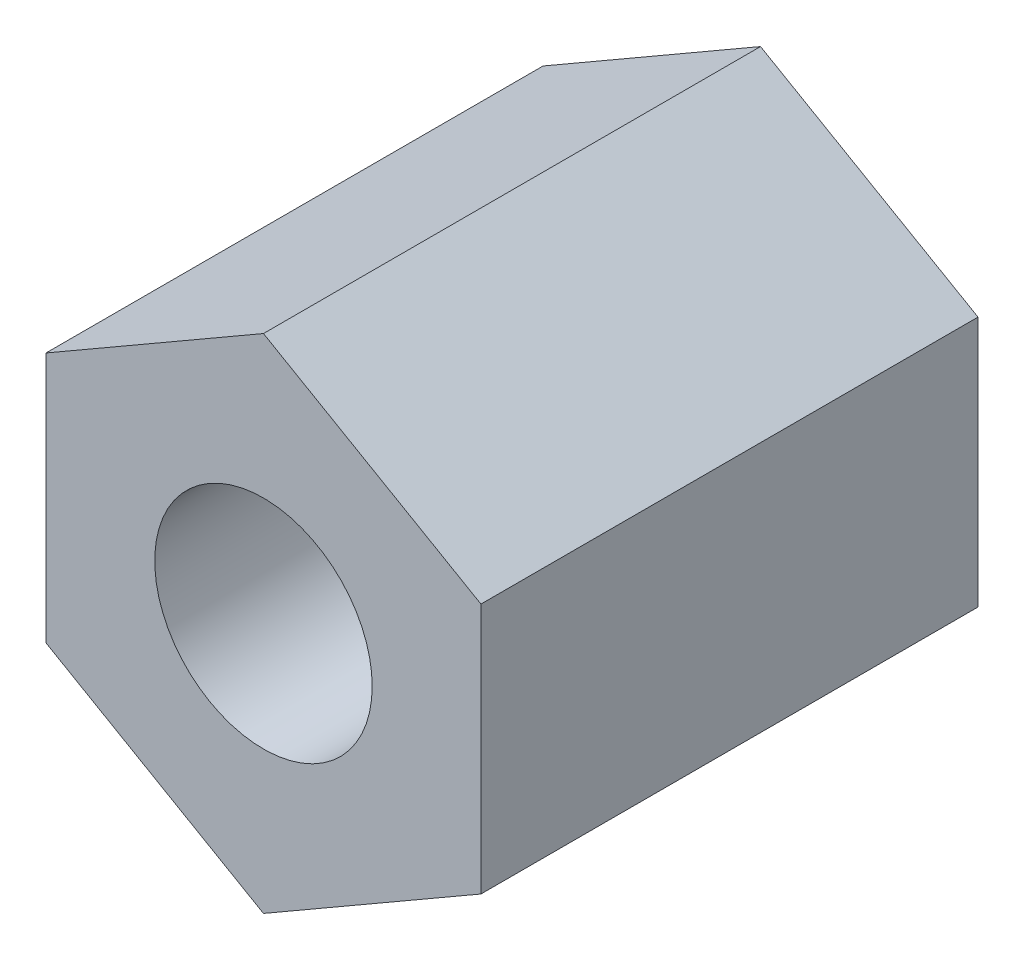
ISO-10303-21;
HEADER;
FILE_DESCRIPTION(('STEP AP214'),'2;1');
FILE_NAME('part.step','',(''),(''),'','','');
FILE_SCHEMA(('AUTOMOTIVE_DESIGN { 1 0 10303 214 1 1 1 1 }'));
ENDSEC;
DATA;
#1=APPLICATION_CONTEXT('core data for automotive mechanical design processes');
#2=APPLICATION_PROTOCOL_DEFINITION('international standard','automotive_design',2000,#1);
#3=PRODUCT_CONTEXT('',#1,'mechanical');
#4=PRODUCT('Part','Part','',(#3));
#5=PRODUCT_RELATED_PRODUCT_CATEGORY('part','',(#4));
#6=PRODUCT_DEFINITION_FORMATION('','',#4);
#7=PRODUCT_DEFINITION_CONTEXT('part definition',#1,'design');
#8=PRODUCT_DEFINITION('design','',#6,#7);
#9=PRODUCT_DEFINITION_SHAPE('','',#8);
#10=(LENGTH_UNIT() NAMED_UNIT(*) SI_UNIT(.MILLI.,.METRE.));
#11=(NAMED_UNIT(*) PLANE_ANGLE_UNIT() SI_UNIT($,.RADIAN.));
#12=(NAMED_UNIT(*) SI_UNIT($,.STERADIAN.) SOLID_ANGLE_UNIT());
#13=UNCERTAINTY_MEASURE_WITH_UNIT(LENGTH_MEASURE(1.E-05),#10,'distance_accuracy_value','');
#14=(GEOMETRIC_REPRESENTATION_CONTEXT(3) GLOBAL_UNCERTAINTY_ASSIGNED_CONTEXT((#13)) GLOBAL_UNIT_ASSIGNED_CONTEXT((#10,
#11,#12)) REPRESENTATION_CONTEXT('',''));
#15=CARTESIAN_POINT('',(0.,0.,0.));
#16=DIRECTION('',(0.,0.,1.));
#17=DIRECTION('',(1.,0.,0.));
#18=AXIS2_PLACEMENT_3D('',#15,#16,#17);
#19=CARTESIAN_POINT('',(0.,0.,8.));
#20=DIRECTION('',(0.,0.,-1.));
#21=DIRECTION('',(-1.,0.,0.));
#22=AXIS2_PLACEMENT_3D('',#19,#20,#21);
#23=PLANE('',#22);
#24=DIRECTION('',(-0.86602540378444,0.499999999999998,0.));
#25=VECTOR('',#24,1.);
#26=CARTESIAN_POINT('',(3.50000000000001,2.02072594216369,8.));
#27=LINE('',#26,#25);
#28=CARTESIAN_POINT('',(3.50000000000001,2.02072594216369,8.));
#29=VERTEX_POINT('',#28);
#30=CARTESIAN_POINT('',(0.,4.04145188432738,8.));
#31=VERTEX_POINT('',#30);
#32=EDGE_CURVE('E128',#29,#31,#27,.T.);
#33=ORIENTED_EDGE('',*,*,#32,.T.);
#34=DIRECTION('',(-0.86602540378444,-0.499999999999998,0.));
#35=VECTOR('',#34,1.);
#36=CARTESIAN_POINT('',(-3.50000000000001,2.02072594216369,8.));
#37=LINE('',#36,#35);
#38=CARTESIAN_POINT('',(-3.50000000000001,2.02072594216369,8.));
#39=VERTEX_POINT('',#38);
#40=EDGE_CURVE('E86',#31,#39,#37,.T.);
#41=ORIENTED_EDGE('',*,*,#40,.T.);
#42=DIRECTION('',(0.,-1.,0.));
#43=VECTOR('',#42,1.);
#44=CARTESIAN_POINT('',(-3.50000000000001,-2.02072594216369,8.));
#45=LINE('',#44,#43);
#46=CARTESIAN_POINT('',(-3.50000000000001,-2.02072594216369,8.));
#47=VERTEX_POINT('',#46);
#48=EDGE_CURVE('E99',#39,#47,#45,.T.);
#49=ORIENTED_EDGE('',*,*,#48,.T.);
#50=DIRECTION('',(0.86602540378444,-0.499999999999998,0.));
#51=VECTOR('',#50,1.);
#52=CARTESIAN_POINT('',(-3.50000000000001,-2.02072594216369,8.));
#53=LINE('',#52,#51);
#54=CARTESIAN_POINT('',(0.,-4.04145188432738,8.));
#55=VERTEX_POINT('',#54);
#56=EDGE_CURVE('E93',#47,#55,#53,.T.);
#57=ORIENTED_EDGE('',*,*,#56,.T.);
#58=DIRECTION('',(0.86602540378444,0.499999999999998,0.));
#59=VECTOR('',#58,1.);
#60=CARTESIAN_POINT('',(3.50000000000001,-2.02072594216369,8.));
#61=LINE('',#60,#59);
#62=CARTESIAN_POINT('',(3.50000000000001,-2.02072594216369,8.));
#63=VERTEX_POINT('',#62);
#64=EDGE_CURVE('E97',#55,#63,#61,.T.);
#65=ORIENTED_EDGE('',*,*,#64,.T.);
#66=DIRECTION('',(0.,1.,0.));
#67=VECTOR('',#66,1.);
#68=CARTESIAN_POINT('',(3.50000000000001,-2.02072594216369,8.));
#69=LINE('',#68,#67);
#70=EDGE_CURVE('E49',#63,#29,#69,.T.);
#71=ORIENTED_EDGE('',*,*,#70,.T.);
#72=EDGE_LOOP('',(#33,#41,#49,#57,#65,#71));
#73=FACE_BOUND('',#72,.T.);
#74=CARTESIAN_POINT('',(0.,0.,8.));
#75=DIRECTION('',(0.,0.,1.));
#76=DIRECTION('',(1.,0.,0.));
#77=AXIS2_PLACEMENT_3D('',#74,#75,#76);
#78=CIRCLE('',#77,1.75);
#79=CARTESIAN_POINT('',(1.75,0.,8.));
#80=VERTEX_POINT('',#79);
#81=EDGE_CURVE('E121',#80,#80,#78,.T.);
#82=ORIENTED_EDGE('',*,*,#81,.F.);
#83=EDGE_LOOP('',(#82));
#84=FACE_BOUND('',#83,.T.);
#85=ADVANCED_FACE('F32',(#73,#84),#23,.F.);
#86=CARTESIAN_POINT('',(0.,0.,0.));
#87=DIRECTION('',(0.,0.,-1.));
#88=DIRECTION('',(-1.,0.,0.));
#89=AXIS2_PLACEMENT_3D('',#86,#87,#88);
#90=PLANE('',#89);
#91=DIRECTION('',(-0.86602540378444,0.499999999999998,0.));
#92=VECTOR('',#91,1.);
#93=CARTESIAN_POINT('',(3.50000000000001,2.02072594216369,0.));
#94=LINE('',#93,#92);
#95=CARTESIAN_POINT('',(3.50000000000001,2.02072594216369,0.));
#96=VERTEX_POINT('',#95);
#97=CARTESIAN_POINT('',(0.,4.04145188432738,0.));
#98=VERTEX_POINT('',#97);
#99=EDGE_CURVE('E117',#96,#98,#94,.T.);
#100=ORIENTED_EDGE('',*,*,#99,.F.);
#101=DIRECTION('',(0.,1.,0.));
#102=VECTOR('',#101,1.);
#103=CARTESIAN_POINT('',(3.50000000000001,-2.02072594216369,0.));
#104=LINE('',#103,#102);
#105=CARTESIAN_POINT('',(3.50000000000001,-2.02072594216369,0.));
#106=VERTEX_POINT('',#105);
#107=EDGE_CURVE('E78',#106,#96,#104,.T.);
#108=ORIENTED_EDGE('',*,*,#107,.F.);
#109=DIRECTION('',(0.86602540378444,0.499999999999998,0.));
#110=VECTOR('',#109,1.);
#111=CARTESIAN_POINT('',(3.50000000000001,-2.02072594216369,0.));
#112=LINE('',#111,#110);
#113=CARTESIAN_POINT('',(0.,-4.04145188432738,0.));
#114=VERTEX_POINT('',#113);
#115=EDGE_CURVE('E72',#114,#106,#112,.T.);
#116=ORIENTED_EDGE('',*,*,#115,.F.);
#117=DIRECTION('',(0.86602540378444,-0.499999999999998,0.));
#118=VECTOR('',#117,1.);
#119=CARTESIAN_POINT('',(-3.50000000000001,-2.02072594216369,0.));
#120=LINE('',#119,#118);
#121=CARTESIAN_POINT('',(-3.50000000000001,-2.02072594216369,0.));
#122=VERTEX_POINT('',#121);
#123=EDGE_CURVE('E107',#122,#114,#120,.T.);
#124=ORIENTED_EDGE('',*,*,#123,.F.);
#125=DIRECTION('',(0.,-1.,0.));
#126=VECTOR('',#125,1.);
#127=CARTESIAN_POINT('',(-3.50000000000001,-2.02072594216369,0.));
#128=LINE('',#127,#126);
#129=CARTESIAN_POINT('',(-3.50000000000001,2.02072594216369,0.));
#130=VERTEX_POINT('',#129);
#131=EDGE_CURVE('E123',#130,#122,#128,.T.);
#132=ORIENTED_EDGE('',*,*,#131,.F.);
#133=DIRECTION('',(-0.86602540378444,-0.499999999999998,0.));
#134=VECTOR('',#133,1.);
#135=CARTESIAN_POINT('',(-3.50000000000001,2.02072594216369,0.));
#136=LINE('',#135,#134);
#137=EDGE_CURVE('E120',#98,#130,#136,.T.);
#138=ORIENTED_EDGE('',*,*,#137,.F.);
#139=EDGE_LOOP('',(#100,#108,#116,#124,#132,#138));
#140=FACE_BOUND('',#139,.T.);
#141=CARTESIAN_POINT('',(0.,0.,0.));
#142=DIRECTION('',(0.,0.,1.));
#143=DIRECTION('',(1.,0.,0.));
#144=AXIS2_PLACEMENT_3D('',#141,#142,#143);
#145=CIRCLE('',#144,1.75);
#146=CARTESIAN_POINT('',(1.75,0.,0.));
#147=VERTEX_POINT('',#146);
#148=EDGE_CURVE('E221',#147,#147,#145,.T.);
#149=ORIENTED_EDGE('',*,*,#148,.T.);
#150=EDGE_LOOP('',(#149));
#151=FACE_BOUND('',#150,.T.);
#152=ADVANCED_FACE('F137',(#140,#151),#90,.T.);
#153=CARTESIAN_POINT('',(3.50000000000001,2.02072594216369,8.));
#154=DIRECTION('',(-0.499999999999998,-0.86602540378444,0.));
#155=DIRECTION('',(0.86602540378444,-0.499999999999998,0.));
#156=AXIS2_PLACEMENT_3D('',#153,#154,#155);
#157=PLANE('',#156);
#158=ORIENTED_EDGE('',*,*,#99,.T.);
#159=DIRECTION('',(0.,0.,-1.));
#160=VECTOR('',#159,1.);
#161=CARTESIAN_POINT('',(0.,4.04145188432738,8.));
#162=LINE('',#161,#160);
#163=EDGE_CURVE('E11',#31,#98,#162,.T.);
#164=ORIENTED_EDGE('',*,*,#163,.F.);
#165=ORIENTED_EDGE('',*,*,#32,.F.);
#166=DIRECTION('',(0.,0.,-1.));
#167=VECTOR('',#166,1.);
#168=CARTESIAN_POINT('',(3.50000000000001,2.02072594216369,8.));
#169=LINE('',#168,#167);
#170=EDGE_CURVE('E113',#29,#96,#169,.T.);
#171=ORIENTED_EDGE('',*,*,#170,.T.);
#172=EDGE_LOOP('',(#158,#164,#165,#171));
#173=FACE_BOUND('',#172,.T.);
#174=ADVANCED_FACE('F34',(#173),#157,.F.);
#175=CARTESIAN_POINT('',(-3.50000000000001,2.02072594216369,8.));
#176=DIRECTION('',(0.499999999999998,-0.86602540378444,0.));
#177=DIRECTION('',(0.86602540378444,0.499999999999998,0.));
#178=AXIS2_PLACEMENT_3D('',#175,#176,#177);
#179=PLANE('',#178);
#180=ORIENTED_EDGE('',*,*,#137,.T.);
#181=DIRECTION('',(0.,0.,-1.));
#182=VECTOR('',#181,1.);
#183=CARTESIAN_POINT('',(-3.50000000000001,2.02072594216369,8.));
#184=LINE('',#183,#182);
#185=EDGE_CURVE('E41',#39,#130,#184,.T.);
#186=ORIENTED_EDGE('',*,*,#185,.F.);
#187=ORIENTED_EDGE('',*,*,#40,.F.);
#188=ORIENTED_EDGE('',*,*,#163,.T.);
#189=EDGE_LOOP('',(#180,#186,#187,#188));
#190=FACE_BOUND('',#189,.T.);
#191=ADVANCED_FACE('F162',(#190),#179,.F.);
#192=CARTESIAN_POINT('',(-3.50000000000001,-2.02072594216369,8.));
#193=DIRECTION('',(1.,0.,0.));
#194=DIRECTION('',(0.,0.,-1.));
#195=AXIS2_PLACEMENT_3D('',#192,#193,#194);
#196=PLANE('',#195);
#197=ORIENTED_EDGE('',*,*,#131,.T.);
#198=DIRECTION('',(0.,0.,-1.));
#199=VECTOR('',#198,1.);
#200=CARTESIAN_POINT('',(-3.50000000000001,-2.02072594216369,8.));
#201=LINE('',#200,#199);
#202=EDGE_CURVE('E108',#47,#122,#201,.T.);
#203=ORIENTED_EDGE('',*,*,#202,.F.);
#204=ORIENTED_EDGE('',*,*,#48,.F.);
#205=ORIENTED_EDGE('',*,*,#185,.T.);
#206=EDGE_LOOP('',(#197,#203,#204,#205));
#207=FACE_BOUND('',#206,.T.);
#208=ADVANCED_FACE('F134',(#207),#196,.F.);
#209=CARTESIAN_POINT('',(-3.50000000000001,-2.02072594216369,8.));
#210=DIRECTION('',(0.499999999999998,0.86602540378444,0.));
#211=DIRECTION('',(-0.86602540378444,0.499999999999998,0.));
#212=AXIS2_PLACEMENT_3D('',#209,#210,#211);
#213=PLANE('',#212);
#214=ORIENTED_EDGE('',*,*,#123,.T.);
#215=DIRECTION('',(0.,0.,-1.));
#216=VECTOR('',#215,1.);
#217=CARTESIAN_POINT('',(0.,-4.04145188432738,8.));
#218=LINE('',#217,#216);
#219=EDGE_CURVE('E104',#55,#114,#218,.T.);
#220=ORIENTED_EDGE('',*,*,#219,.F.);
#221=ORIENTED_EDGE('',*,*,#56,.F.);
#222=ORIENTED_EDGE('',*,*,#202,.T.);
#223=EDGE_LOOP('',(#214,#220,#221,#222));
#224=FACE_BOUND('',#223,.T.);
#225=ADVANCED_FACE('F105',(#224),#213,.F.);
#226=CARTESIAN_POINT('',(3.50000000000001,-2.02072594216369,8.));
#227=DIRECTION('',(-0.499999999999998,0.86602540378444,0.));
#228=DIRECTION('',(-0.86602540378444,-0.499999999999998,0.));
#229=AXIS2_PLACEMENT_3D('',#226,#227,#228);
#230=PLANE('',#229);
#231=ORIENTED_EDGE('',*,*,#115,.T.);
#232=DIRECTION('',(0.,0.,-1.));
#233=VECTOR('',#232,1.);
#234=CARTESIAN_POINT('',(3.50000000000001,-2.02072594216369,8.));
#235=LINE('',#234,#233);
#236=EDGE_CURVE('E109',#63,#106,#235,.T.);
#237=ORIENTED_EDGE('',*,*,#236,.F.);
#238=ORIENTED_EDGE('',*,*,#64,.F.);
#239=ORIENTED_EDGE('',*,*,#219,.T.);
#240=EDGE_LOOP('',(#231,#237,#238,#239));
#241=FACE_BOUND('',#240,.T.);
#242=ADVANCED_FACE('F111',(#241),#230,.F.);
#243=CARTESIAN_POINT('',(3.50000000000001,-2.02072594216369,8.));
#244=DIRECTION('',(-1.,0.,0.));
#245=DIRECTION('',(0.,-1.,0.));
#246=AXIS2_PLACEMENT_3D('',#243,#244,#245);
#247=PLANE('',#246);
#248=ORIENTED_EDGE('',*,*,#107,.T.);
#249=ORIENTED_EDGE('',*,*,#170,.F.);
#250=ORIENTED_EDGE('',*,*,#70,.F.);
#251=ORIENTED_EDGE('',*,*,#236,.T.);
#252=EDGE_LOOP('',(#248,#249,#250,#251));
#253=FACE_BOUND('',#252,.T.);
#254=ADVANCED_FACE('F142',(#253),#247,.F.);
#255=CARTESIAN_POINT('',(0.,0.,8.));
#256=DIRECTION('',(0.,0.,-1.));
#257=DIRECTION('',(-1.,0.,0.));
#258=AXIS2_PLACEMENT_3D('',#255,#256,#257);
#259=CYLINDRICAL_SURFACE('',#258,1.75);
#260=ORIENTED_EDGE('',*,*,#81,.T.);
#261=EDGE_LOOP('',(#260));
#262=FACE_BOUND('',#261,.T.);
#263=ORIENTED_EDGE('',*,*,#148,.F.);
#264=EDGE_LOOP('',(#263));
#265=FACE_BOUND('',#264,.T.);
#266=ADVANCED_FACE('F144',(#262,#265),#259,.F.);
#267=CLOSED_SHELL('',(#85,#152,#174,#191,#208,#225,#242,#254,#266));
#268=MANIFOLD_SOLID_BREP('B2',#267);
#269=ADVANCED_BREP_SHAPE_REPRESENTATION('',(#18,#268),#14);
#270=SHAPE_DEFINITION_REPRESENTATION(#9,#269);
ENDSEC;
END-ISO-10303-21;
